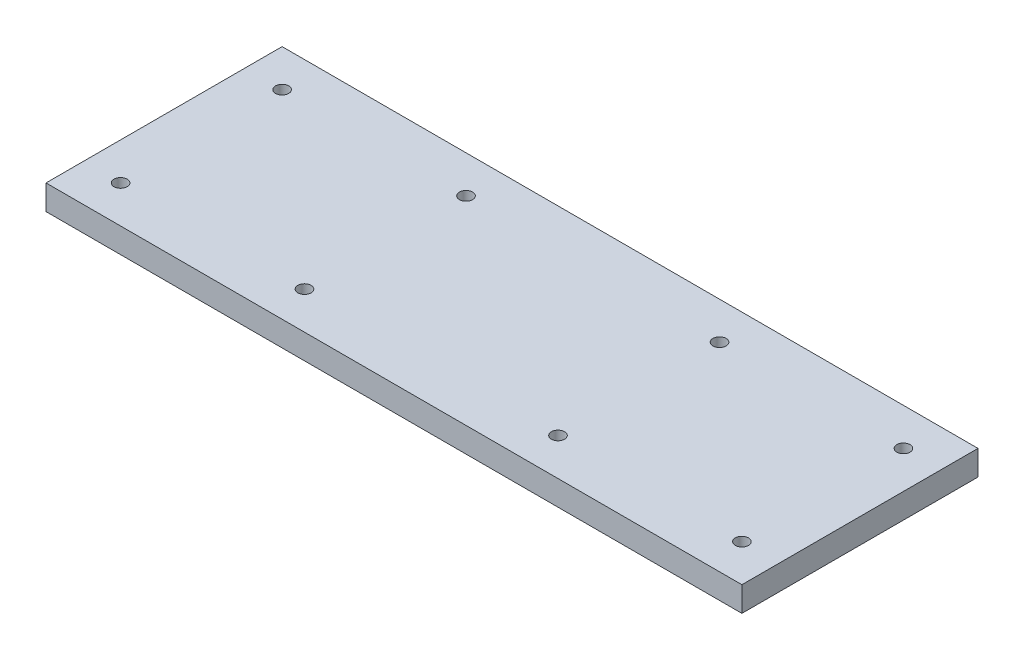
ISO-10303-21;
HEADER;
FILE_DESCRIPTION(('STEP AP214'),'2;1');
FILE_NAME('part.step','',(''),(''),'','','');
FILE_SCHEMA(('AUTOMOTIVE_DESIGN { 1 0 10303 214 1 1 1 1 }'));
ENDSEC;
DATA;
#1=APPLICATION_CONTEXT('core data for automotive mechanical design processes');
#2=APPLICATION_PROTOCOL_DEFINITION('international standard','automotive_design',2000,#1);
#3=PRODUCT_CONTEXT('',#1,'mechanical');
#4=PRODUCT('Part','Part','',(#3));
#5=PRODUCT_RELATED_PRODUCT_CATEGORY('part','',(#4));
#6=PRODUCT_DEFINITION_FORMATION('','',#4);
#7=PRODUCT_DEFINITION_CONTEXT('part definition',#1,'design');
#8=PRODUCT_DEFINITION('design','',#6,#7);
#9=PRODUCT_DEFINITION_SHAPE('','',#8);
#10=(LENGTH_UNIT() NAMED_UNIT(*) SI_UNIT(.MILLI.,.METRE.));
#11=(NAMED_UNIT(*) PLANE_ANGLE_UNIT() SI_UNIT($,.RADIAN.));
#12=(NAMED_UNIT(*) SI_UNIT($,.STERADIAN.) SOLID_ANGLE_UNIT());
#13=UNCERTAINTY_MEASURE_WITH_UNIT(LENGTH_MEASURE(1.E-05),#10,'distance_accuracy_value','');
#14=(GEOMETRIC_REPRESENTATION_CONTEXT(3) GLOBAL_UNCERTAINTY_ASSIGNED_CONTEXT((#13)) GLOBAL_UNIT_ASSIGNED_CONTEXT((#10,
#11,#12)) REPRESENTATION_CONTEXT('',''));
#15=CARTESIAN_POINT('',(0.,0.,0.));
#16=DIRECTION('',(0.,0.,1.));
#17=DIRECTION('',(1.,0.,0.));
#18=AXIS2_PLACEMENT_3D('',#15,#16,#17);
#19=CARTESIAN_POINT('',(140.,10.,47.5));
#20=DIRECTION('',(-1.,0.,0.));
#21=DIRECTION('',(0.,0.,1.));
#22=AXIS2_PLACEMENT_3D('',#19,#20,#21);
#23=PLANE('',#22);
#24=DIRECTION('',(0.,0.,-1.));
#25=VECTOR('',#24,1.);
#26=CARTESIAN_POINT('',(140.,0.,47.5));
#27=LINE('',#26,#25);
#28=CARTESIAN_POINT('',(140.,0.,47.5));
#29=VERTEX_POINT('',#28);
#30=CARTESIAN_POINT('',(140.,0.,-47.5));
#31=VERTEX_POINT('',#30);
#32=EDGE_CURVE('E97',#29,#31,#27,.T.);
#33=ORIENTED_EDGE('',*,*,#32,.T.);
#34=DIRECTION('',(0.,-1.,0.));
#35=VECTOR('',#34,1.);
#36=CARTESIAN_POINT('',(140.,10.,-47.5));
#37=LINE('',#36,#35);
#38=CARTESIAN_POINT('',(140.,10.,-47.5));
#39=VERTEX_POINT('',#38);
#40=EDGE_CURVE('E11',#39,#31,#37,.T.);
#41=ORIENTED_EDGE('',*,*,#40,.F.);
#42=DIRECTION('',(0.,0.,-1.));
#43=VECTOR('',#42,1.);
#44=CARTESIAN_POINT('',(140.,10.,47.5));
#45=LINE('',#44,#43);
#46=CARTESIAN_POINT('',(140.,10.,47.5));
#47=VERTEX_POINT('',#46);
#48=EDGE_CURVE('E85',#47,#39,#45,.T.);
#49=ORIENTED_EDGE('',*,*,#48,.F.);
#50=DIRECTION('',(0.,-1.,0.));
#51=VECTOR('',#50,1.);
#52=CARTESIAN_POINT('',(140.,10.,47.5));
#53=LINE('',#52,#51);
#54=EDGE_CURVE('E93',#47,#29,#53,.T.);
#55=ORIENTED_EDGE('',*,*,#54,.T.);
#56=EDGE_LOOP('',(#33,#41,#49,#55));
#57=FACE_BOUND('',#56,.T.);
#58=ADVANCED_FACE('F34',(#57),#23,.F.);
#59=CARTESIAN_POINT('',(-140.,10.,-47.5));
#60=DIRECTION('',(0.,0.,1.));
#61=DIRECTION('',(1.,0.,0.));
#62=AXIS2_PLACEMENT_3D('',#59,#60,#61);
#63=PLANE('',#62);
#64=DIRECTION('',(-1.,0.,0.));
#65=VECTOR('',#64,1.);
#66=CARTESIAN_POINT('',(-140.,0.,-47.5));
#67=LINE('',#66,#65);
#68=CARTESIAN_POINT('',(-140.,0.,-47.5));
#69=VERTEX_POINT('',#68);
#70=EDGE_CURVE('E89',#31,#69,#67,.T.);
#71=ORIENTED_EDGE('',*,*,#70,.T.);
#72=DIRECTION('',(0.,-1.,0.));
#73=VECTOR('',#72,1.);
#74=CARTESIAN_POINT('',(-140.,10.,-47.5));
#75=LINE('',#74,#73);
#76=CARTESIAN_POINT('',(-140.,10.,-47.5));
#77=VERTEX_POINT('',#76);
#78=EDGE_CURVE('E42',#77,#69,#75,.T.);
#79=ORIENTED_EDGE('',*,*,#78,.F.);
#80=DIRECTION('',(-1.,0.,0.));
#81=VECTOR('',#80,1.);
#82=CARTESIAN_POINT('',(-140.,10.,-47.5));
#83=LINE('',#82,#81);
#84=EDGE_CURVE('E80',#39,#77,#83,.T.);
#85=ORIENTED_EDGE('',*,*,#84,.F.);
#86=ORIENTED_EDGE('',*,*,#40,.T.);
#87=EDGE_LOOP('',(#71,#79,#85,#86));
#88=FACE_BOUND('',#87,.T.);
#89=ADVANCED_FACE('F88',(#88),#63,.F.);
#90=CARTESIAN_POINT('',(-140.,10.,47.5));
#91=DIRECTION('',(1.,0.,0.));
#92=DIRECTION('',(0.,0.,-1.));
#93=AXIS2_PLACEMENT_3D('',#90,#91,#92);
#94=PLANE('',#93);
#95=DIRECTION('',(0.,0.,1.));
#96=VECTOR('',#95,1.);
#97=CARTESIAN_POINT('',(-140.,0.,47.5));
#98=LINE('',#97,#96);
#99=CARTESIAN_POINT('',(-140.,0.,47.5));
#100=VERTEX_POINT('',#99);
#101=EDGE_CURVE('E67',#69,#100,#98,.T.);
#102=ORIENTED_EDGE('',*,*,#101,.T.);
#103=DIRECTION('',(0.,-1.,0.));
#104=VECTOR('',#103,1.);
#105=CARTESIAN_POINT('',(-140.,10.,47.5));
#106=LINE('',#105,#104);
#107=CARTESIAN_POINT('',(-140.,10.,47.5));
#108=VERTEX_POINT('',#107);
#109=EDGE_CURVE('E90',#108,#100,#106,.T.);
#110=ORIENTED_EDGE('',*,*,#109,.F.);
#111=DIRECTION('',(0.,0.,1.));
#112=VECTOR('',#111,1.);
#113=CARTESIAN_POINT('',(-140.,10.,47.5));
#114=LINE('',#113,#112);
#115=EDGE_CURVE('E83',#77,#108,#114,.T.);
#116=ORIENTED_EDGE('',*,*,#115,.F.);
#117=ORIENTED_EDGE('',*,*,#78,.T.);
#118=EDGE_LOOP('',(#102,#110,#116,#117));
#119=FACE_BOUND('',#118,.T.);
#120=ADVANCED_FACE('F91',(#119),#94,.F.);
#121=CARTESIAN_POINT('',(-140.,10.,47.5));
#122=DIRECTION('',(0.,0.,-1.));
#123=DIRECTION('',(-1.,0.,0.));
#124=AXIS2_PLACEMENT_3D('',#121,#122,#123);
#125=PLANE('',#124);
#126=DIRECTION('',(1.,0.,0.));
#127=VECTOR('',#126,1.);
#128=CARTESIAN_POINT('',(-140.,0.,47.5));
#129=LINE('',#128,#127);
#130=EDGE_CURVE('E73',#100,#29,#129,.T.);
#131=ORIENTED_EDGE('',*,*,#130,.T.);
#132=ORIENTED_EDGE('',*,*,#54,.F.);
#133=DIRECTION('',(1.,0.,0.));
#134=VECTOR('',#133,1.);
#135=CARTESIAN_POINT('',(-140.,10.,47.5));
#136=LINE('',#135,#134);
#137=EDGE_CURVE('E50',#108,#47,#136,.T.);
#138=ORIENTED_EDGE('',*,*,#137,.F.);
#139=ORIENTED_EDGE('',*,*,#109,.T.);
#140=EDGE_LOOP('',(#131,#132,#138,#139));
#141=FACE_BOUND('',#140,.T.);
#142=ADVANCED_FACE('F105',(#141),#125,.F.);
#143=CARTESIAN_POINT('',(0.,10.,0.));
#144=DIRECTION('',(0.,-1.,0.));
#145=DIRECTION('',(0.,0.,-1.));
#146=AXIS2_PLACEMENT_3D('',#143,#144,#145);
#147=PLANE('',#146);
#148=CARTESIAN_POINT('',(-125.,10.,32.5));
#149=DIRECTION('',(0.,1.,0.));
#150=DIRECTION('',(0.,0.,1.));
#151=AXIS2_PLACEMENT_3D('',#148,#149,#150);
#152=CIRCLE('',#151,2.64999999999999);
#153=CARTESIAN_POINT('',(-125.,10.,35.15));
#154=VERTEX_POINT('',#153);
#155=EDGE_CURVE('E155',#154,#154,#152,.T.);
#156=ORIENTED_EDGE('',*,*,#155,.F.);
#157=EDGE_LOOP('',(#156));
#158=FACE_BOUND('',#157,.T.);
#159=CARTESIAN_POINT('',(-125.,10.,-32.5));
#160=DIRECTION('',(0.,1.,0.));
#161=DIRECTION('',(0.,0.,1.));
#162=AXIS2_PLACEMENT_3D('',#159,#160,#161);
#163=CIRCLE('',#162,2.64999999999999);
#164=CARTESIAN_POINT('',(-125.,10.,-29.85));
#165=VERTEX_POINT('',#164);
#166=EDGE_CURVE('E149',#165,#165,#163,.T.);
#167=ORIENTED_EDGE('',*,*,#166,.F.);
#168=EDGE_LOOP('',(#167));
#169=FACE_BOUND('',#168,.T.);
#170=CARTESIAN_POINT('',(-51.,10.,-32.5));
#171=DIRECTION('',(0.,1.,0.));
#172=DIRECTION('',(0.,0.,1.));
#173=AXIS2_PLACEMENT_3D('',#170,#171,#172);
#174=CIRCLE('',#173,2.64999999999999);
#175=CARTESIAN_POINT('',(-51.,10.,-29.85));
#176=VERTEX_POINT('',#175);
#177=EDGE_CURVE('E143',#176,#176,#174,.T.);
#178=ORIENTED_EDGE('',*,*,#177,.F.);
#179=EDGE_LOOP('',(#178));
#180=FACE_BOUND('',#179,.T.);
#181=CARTESIAN_POINT('',(-51.,10.,32.5));
#182=DIRECTION('',(0.,1.,0.));
#183=DIRECTION('',(0.,0.,1.));
#184=AXIS2_PLACEMENT_3D('',#181,#182,#183);
#185=CIRCLE('',#184,2.64999999999999);
#186=CARTESIAN_POINT('',(-51.,10.,35.15));
#187=VERTEX_POINT('',#186);
#188=EDGE_CURVE('E137',#187,#187,#185,.T.);
#189=ORIENTED_EDGE('',*,*,#188,.F.);
#190=EDGE_LOOP('',(#189));
#191=FACE_BOUND('',#190,.T.);
#192=CARTESIAN_POINT('',(125.,10.,-32.5));
#193=DIRECTION('',(0.,1.,0.));
#194=DIRECTION('',(0.,0.,1.));
#195=AXIS2_PLACEMENT_3D('',#192,#193,#194);
#196=CIRCLE('',#195,2.64999999999999);
#197=CARTESIAN_POINT('',(125.,10.,-29.85));
#198=VERTEX_POINT('',#197);
#199=EDGE_CURVE('E131',#198,#198,#196,.T.);
#200=ORIENTED_EDGE('',*,*,#199,.F.);
#201=EDGE_LOOP('',(#200));
#202=FACE_BOUND('',#201,.T.);
#203=CARTESIAN_POINT('',(125.,10.,32.5));
#204=DIRECTION('',(0.,1.,0.));
#205=DIRECTION('',(0.,0.,1.));
#206=AXIS2_PLACEMENT_3D('',#203,#204,#205);
#207=CIRCLE('',#206,2.64999999999999);
#208=CARTESIAN_POINT('',(125.,10.,35.15));
#209=VERTEX_POINT('',#208);
#210=EDGE_CURVE('E125',#209,#209,#207,.T.);
#211=ORIENTED_EDGE('',*,*,#210,.F.);
#212=EDGE_LOOP('',(#211));
#213=FACE_BOUND('',#212,.T.);
#214=CARTESIAN_POINT('',(51.,10.,32.5));
#215=DIRECTION('',(0.,1.,0.));
#216=DIRECTION('',(0.,0.,1.));
#217=AXIS2_PLACEMENT_3D('',#214,#215,#216);
#218=CIRCLE('',#217,2.64999999999999);
#219=CARTESIAN_POINT('',(51.,10.,35.15));
#220=VERTEX_POINT('',#219);
#221=EDGE_CURVE('E119',#220,#220,#218,.T.);
#222=ORIENTED_EDGE('',*,*,#221,.F.);
#223=EDGE_LOOP('',(#222));
#224=FACE_BOUND('',#223,.T.);
#225=CARTESIAN_POINT('',(51.,10.,-32.5));
#226=DIRECTION('',(0.,1.,0.));
#227=DIRECTION('',(0.,0.,1.));
#228=AXIS2_PLACEMENT_3D('',#225,#226,#227);
#229=CIRCLE('',#228,2.64999999999999);
#230=CARTESIAN_POINT('',(51.,10.,-29.85));
#231=VERTEX_POINT('',#230);
#232=EDGE_CURVE('E113',#231,#231,#229,.T.);
#233=ORIENTED_EDGE('',*,*,#232,.F.);
#234=EDGE_LOOP('',(#233));
#235=FACE_BOUND('',#234,.T.);
#236=ORIENTED_EDGE('',*,*,#48,.T.);
#237=ORIENTED_EDGE('',*,*,#84,.T.);
#238=ORIENTED_EDGE('',*,*,#115,.T.);
#239=ORIENTED_EDGE('',*,*,#137,.T.);
#240=EDGE_LOOP('',(#236,#237,#238,#239));
#241=FACE_BOUND('',#240,.T.);
#242=ADVANCED_FACE('F81',(#158,#169,#180,#191,#202,#213,#224,#235,#241),#147,.F.);
#243=CARTESIAN_POINT('',(0.,0.,0.));
#244=DIRECTION('',(0.,-1.,0.));
#245=DIRECTION('',(0.,0.,-1.));
#246=AXIS2_PLACEMENT_3D('',#243,#244,#245);
#247=PLANE('',#246);
#248=CARTESIAN_POINT('',(-125.,0.,32.5));
#249=DIRECTION('',(0.,1.,0.));
#250=DIRECTION('',(0.,0.,1.));
#251=AXIS2_PLACEMENT_3D('',#248,#249,#250);
#252=CIRCLE('',#251,2.64999999999999);
#253=CARTESIAN_POINT('',(-125.,0.,35.15));
#254=VERTEX_POINT('',#253);
#255=EDGE_CURVE('E152',#254,#254,#252,.T.);
#256=ORIENTED_EDGE('',*,*,#255,.T.);
#257=EDGE_LOOP('',(#256));
#258=FACE_BOUND('',#257,.T.);
#259=CARTESIAN_POINT('',(-125.,0.,-32.5));
#260=DIRECTION('',(0.,1.,0.));
#261=DIRECTION('',(0.,0.,1.));
#262=AXIS2_PLACEMENT_3D('',#259,#260,#261);
#263=CIRCLE('',#262,2.64999999999999);
#264=CARTESIAN_POINT('',(-125.,0.,-29.85));
#265=VERTEX_POINT('',#264);
#266=EDGE_CURVE('E146',#265,#265,#263,.T.);
#267=ORIENTED_EDGE('',*,*,#266,.T.);
#268=EDGE_LOOP('',(#267));
#269=FACE_BOUND('',#268,.T.);
#270=CARTESIAN_POINT('',(-51.,0.,-32.5));
#271=DIRECTION('',(0.,1.,0.));
#272=DIRECTION('',(0.,0.,1.));
#273=AXIS2_PLACEMENT_3D('',#270,#271,#272);
#274=CIRCLE('',#273,2.64999999999999);
#275=CARTESIAN_POINT('',(-51.,0.,-29.85));
#276=VERTEX_POINT('',#275);
#277=EDGE_CURVE('E140',#276,#276,#274,.T.);
#278=ORIENTED_EDGE('',*,*,#277,.T.);
#279=EDGE_LOOP('',(#278));
#280=FACE_BOUND('',#279,.T.);
#281=CARTESIAN_POINT('',(-51.,0.,32.5));
#282=DIRECTION('',(0.,1.,0.));
#283=DIRECTION('',(0.,0.,1.));
#284=AXIS2_PLACEMENT_3D('',#281,#282,#283);
#285=CIRCLE('',#284,2.64999999999999);
#286=CARTESIAN_POINT('',(-51.,0.,35.15));
#287=VERTEX_POINT('',#286);
#288=EDGE_CURVE('E134',#287,#287,#285,.T.);
#289=ORIENTED_EDGE('',*,*,#288,.T.);
#290=EDGE_LOOP('',(#289));
#291=FACE_BOUND('',#290,.T.);
#292=CARTESIAN_POINT('',(125.,0.,-32.5));
#293=DIRECTION('',(0.,1.,0.));
#294=DIRECTION('',(0.,0.,1.));
#295=AXIS2_PLACEMENT_3D('',#292,#293,#294);
#296=CIRCLE('',#295,2.64999999999999);
#297=CARTESIAN_POINT('',(125.,0.,-29.85));
#298=VERTEX_POINT('',#297);
#299=EDGE_CURVE('E128',#298,#298,#296,.T.);
#300=ORIENTED_EDGE('',*,*,#299,.T.);
#301=EDGE_LOOP('',(#300));
#302=FACE_BOUND('',#301,.T.);
#303=CARTESIAN_POINT('',(125.,0.,32.5));
#304=DIRECTION('',(0.,1.,0.));
#305=DIRECTION('',(0.,0.,1.));
#306=AXIS2_PLACEMENT_3D('',#303,#304,#305);
#307=CIRCLE('',#306,2.64999999999999);
#308=CARTESIAN_POINT('',(125.,0.,35.15));
#309=VERTEX_POINT('',#308);
#310=EDGE_CURVE('E122',#309,#309,#307,.T.);
#311=ORIENTED_EDGE('',*,*,#310,.T.);
#312=EDGE_LOOP('',(#311));
#313=FACE_BOUND('',#312,.T.);
#314=CARTESIAN_POINT('',(51.,0.,32.5));
#315=DIRECTION('',(0.,1.,0.));
#316=DIRECTION('',(0.,0.,1.));
#317=AXIS2_PLACEMENT_3D('',#314,#315,#316);
#318=CIRCLE('',#317,2.64999999999999);
#319=CARTESIAN_POINT('',(51.,0.,35.15));
#320=VERTEX_POINT('',#319);
#321=EDGE_CURVE('E116',#320,#320,#318,.T.);
#322=ORIENTED_EDGE('',*,*,#321,.T.);
#323=EDGE_LOOP('',(#322));
#324=FACE_BOUND('',#323,.T.);
#325=CARTESIAN_POINT('',(51.,0.,-32.5));
#326=DIRECTION('',(0.,1.,0.));
#327=DIRECTION('',(0.,0.,1.));
#328=AXIS2_PLACEMENT_3D('',#325,#326,#327);
#329=CIRCLE('',#328,2.64999999999999);
#330=CARTESIAN_POINT('',(51.,0.,-29.85));
#331=VERTEX_POINT('',#330);
#332=EDGE_CURVE('E100',#331,#331,#329,.T.);
#333=ORIENTED_EDGE('',*,*,#332,.T.);
#334=EDGE_LOOP('',(#333));
#335=FACE_BOUND('',#334,.T.);
#336=ORIENTED_EDGE('',*,*,#32,.F.);
#337=ORIENTED_EDGE('',*,*,#130,.F.);
#338=ORIENTED_EDGE('',*,*,#101,.F.);
#339=ORIENTED_EDGE('',*,*,#70,.F.);
#340=EDGE_LOOP('',(#336,#337,#338,#339));
#341=FACE_BOUND('',#340,.T.);
#342=ADVANCED_FACE('F108',(#258,#269,#280,#291,#302,#313,#324,#335,#341),#247,.T.);
#343=CARTESIAN_POINT('',(51.,10.,-32.5));
#344=DIRECTION('',(0.,1.,0.));
#345=DIRECTION('',(0.,0.,1.));
#346=AXIS2_PLACEMENT_3D('',#343,#344,#345);
#347=CYLINDRICAL_SURFACE('',#346,2.64999999999999);
#348=ORIENTED_EDGE('',*,*,#332,.F.);
#349=EDGE_LOOP('',(#348));
#350=FACE_BOUND('',#349,.T.);
#351=ORIENTED_EDGE('',*,*,#232,.T.);
#352=EDGE_LOOP('',(#351));
#353=FACE_BOUND('',#352,.T.);
#354=ADVANCED_FACE('F178',(#350,#353),#347,.F.);
#355=CARTESIAN_POINT('',(51.,10.,32.5));
#356=DIRECTION('',(0.,1.,0.));
#357=DIRECTION('',(0.,0.,1.));
#358=AXIS2_PLACEMENT_3D('',#355,#356,#357);
#359=CYLINDRICAL_SURFACE('',#358,2.64999999999999);
#360=ORIENTED_EDGE('',*,*,#321,.F.);
#361=EDGE_LOOP('',(#360));
#362=FACE_BOUND('',#361,.T.);
#363=ORIENTED_EDGE('',*,*,#221,.T.);
#364=EDGE_LOOP('',(#363));
#365=FACE_BOUND('',#364,.T.);
#366=ADVANCED_FACE('F180',(#362,#365),#359,.F.);
#367=CARTESIAN_POINT('',(125.,10.,32.5));
#368=DIRECTION('',(0.,1.,0.));
#369=DIRECTION('',(0.,0.,1.));
#370=AXIS2_PLACEMENT_3D('',#367,#368,#369);
#371=CYLINDRICAL_SURFACE('',#370,2.64999999999999);
#372=ORIENTED_EDGE('',*,*,#310,.F.);
#373=EDGE_LOOP('',(#372));
#374=FACE_BOUND('',#373,.T.);
#375=ORIENTED_EDGE('',*,*,#210,.T.);
#376=EDGE_LOOP('',(#375));
#377=FACE_BOUND('',#376,.T.);
#378=ADVANCED_FACE('F187',(#374,#377),#371,.F.);
#379=CARTESIAN_POINT('',(125.,10.,-32.5));
#380=DIRECTION('',(0.,1.,0.));
#381=DIRECTION('',(0.,0.,1.));
#382=AXIS2_PLACEMENT_3D('',#379,#380,#381);
#383=CYLINDRICAL_SURFACE('',#382,2.64999999999999);
#384=ORIENTED_EDGE('',*,*,#299,.F.);
#385=EDGE_LOOP('',(#384));
#386=FACE_BOUND('',#385,.T.);
#387=ORIENTED_EDGE('',*,*,#199,.T.);
#388=EDGE_LOOP('',(#387));
#389=FACE_BOUND('',#388,.T.);
#390=ADVANCED_FACE('F234',(#386,#389),#383,.F.);
#391=CARTESIAN_POINT('',(-51.,10.,32.5));
#392=DIRECTION('',(0.,1.,0.));
#393=DIRECTION('',(0.,0.,1.));
#394=AXIS2_PLACEMENT_3D('',#391,#392,#393);
#395=CYLINDRICAL_SURFACE('',#394,2.64999999999999);
#396=ORIENTED_EDGE('',*,*,#288,.F.);
#397=EDGE_LOOP('',(#396));
#398=FACE_BOUND('',#397,.T.);
#399=ORIENTED_EDGE('',*,*,#188,.T.);
#400=EDGE_LOOP('',(#399));
#401=FACE_BOUND('',#400,.T.);
#402=ADVANCED_FACE('F244',(#398,#401),#395,.F.);
#403=CARTESIAN_POINT('',(-51.,10.,-32.5));
#404=DIRECTION('',(0.,1.,0.));
#405=DIRECTION('',(0.,0.,1.));
#406=AXIS2_PLACEMENT_3D('',#403,#404,#405);
#407=CYLINDRICAL_SURFACE('',#406,2.64999999999999);
#408=ORIENTED_EDGE('',*,*,#277,.F.);
#409=EDGE_LOOP('',(#408));
#410=FACE_BOUND('',#409,.T.);
#411=ORIENTED_EDGE('',*,*,#177,.T.);
#412=EDGE_LOOP('',(#411));
#413=FACE_BOUND('',#412,.T.);
#414=ADVANCED_FACE('F254',(#410,#413),#407,.F.);
#415=CARTESIAN_POINT('',(-125.,10.,-32.5));
#416=DIRECTION('',(0.,1.,0.));
#417=DIRECTION('',(0.,0.,1.));
#418=AXIS2_PLACEMENT_3D('',#415,#416,#417);
#419=CYLINDRICAL_SURFACE('',#418,2.64999999999999);
#420=ORIENTED_EDGE('',*,*,#266,.F.);
#421=EDGE_LOOP('',(#420));
#422=FACE_BOUND('',#421,.T.);
#423=ORIENTED_EDGE('',*,*,#166,.T.);
#424=EDGE_LOOP('',(#423));
#425=FACE_BOUND('',#424,.T.);
#426=ADVANCED_FACE('F264',(#422,#425),#419,.F.);
#427=CARTESIAN_POINT('',(-125.,10.,32.5));
#428=DIRECTION('',(0.,1.,0.));
#429=DIRECTION('',(0.,0.,1.));
#430=AXIS2_PLACEMENT_3D('',#427,#428,#429);
#431=CYLINDRICAL_SURFACE('',#430,2.64999999999999);
#432=ORIENTED_EDGE('',*,*,#255,.F.);
#433=EDGE_LOOP('',(#432));
#434=FACE_BOUND('',#433,.T.);
#435=ORIENTED_EDGE('',*,*,#155,.T.);
#436=EDGE_LOOP('',(#435));
#437=FACE_BOUND('',#436,.T.);
#438=ADVANCED_FACE('F159',(#434,#437),#431,.F.);
#439=CLOSED_SHELL('',(#58,#89,#120,#142,#242,#342,#354,#366,#378,#390,#402,#414,#426,#438));
#440=MANIFOLD_SOLID_BREP('B2',#439);
#441=ADVANCED_BREP_SHAPE_REPRESENTATION('',(#18,#440),#14);
#442=SHAPE_DEFINITION_REPRESENTATION(#9,#441);
ENDSEC;
END-ISO-10303-21;
